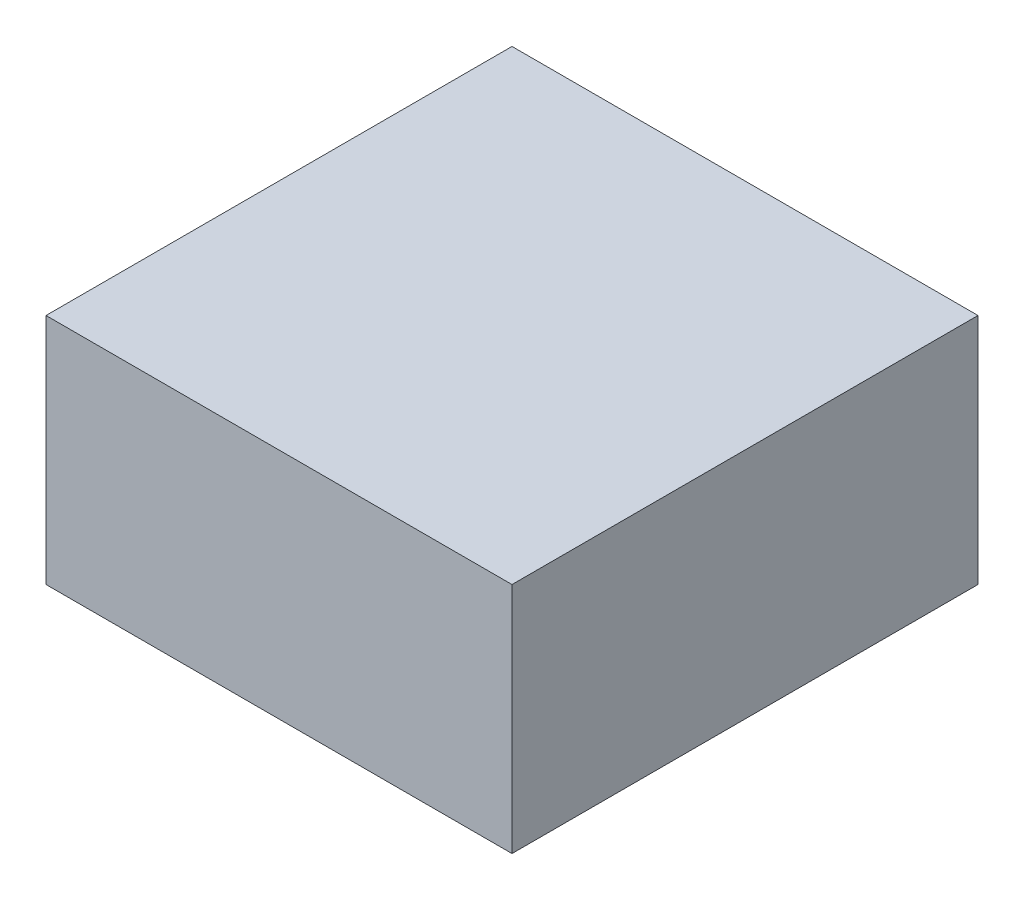
ISO-10303-21;
HEADER;
FILE_DESCRIPTION(('STEP AP214'),'2;1');
FILE_NAME('part.step','',(''),(''),'','','');
FILE_SCHEMA(('AUTOMOTIVE_DESIGN { 1 0 10303 214 1 1 1 1 }'));
ENDSEC;
DATA;
#1=APPLICATION_CONTEXT('core data for automotive mechanical design processes');
#2=APPLICATION_PROTOCOL_DEFINITION('international standard','automotive_design',2000,#1);
#3=PRODUCT_CONTEXT('',#1,'mechanical');
#4=PRODUCT('Part','Part','',(#3));
#5=PRODUCT_RELATED_PRODUCT_CATEGORY('part','',(#4));
#6=PRODUCT_DEFINITION_FORMATION('','',#4);
#7=PRODUCT_DEFINITION_CONTEXT('part definition',#1,'design');
#8=PRODUCT_DEFINITION('design','',#6,#7);
#9=PRODUCT_DEFINITION_SHAPE('','',#8);
#10=(LENGTH_UNIT() NAMED_UNIT(*) SI_UNIT(.MILLI.,.METRE.));
#11=(NAMED_UNIT(*) PLANE_ANGLE_UNIT() SI_UNIT($,.RADIAN.));
#12=(NAMED_UNIT(*) SI_UNIT($,.STERADIAN.) SOLID_ANGLE_UNIT());
#13=UNCERTAINTY_MEASURE_WITH_UNIT(LENGTH_MEASURE(1.E-05),#10,'distance_accuracy_value','');
#14=(GEOMETRIC_REPRESENTATION_CONTEXT(3) GLOBAL_UNCERTAINTY_ASSIGNED_CONTEXT((#13)) GLOBAL_UNIT_ASSIGNED_CONTEXT((#10,
#11,#12)) REPRESENTATION_CONTEXT('',''));
#15=CARTESIAN_POINT('',(0.,0.,0.));
#16=DIRECTION('',(0.,0.,1.));
#17=DIRECTION('',(1.,0.,0.));
#18=AXIS2_PLACEMENT_3D('',#15,#16,#17);
#19=CARTESIAN_POINT('',(250.,125.,250.));
#20=DIRECTION('',(-1.,0.,0.));
#21=DIRECTION('',(0.,0.,1.));
#22=AXIS2_PLACEMENT_3D('',#19,#20,#21);
#23=PLANE('',#22);
#24=DIRECTION('',(0.,0.,-1.));
#25=VECTOR('',#24,1.);
#26=CARTESIAN_POINT('',(250.,-125.,250.));
#27=LINE('',#26,#25);
#28=CARTESIAN_POINT('',(250.,-125.,250.));
#29=VERTEX_POINT('',#28);
#30=CARTESIAN_POINT('',(250.,-125.,-250.));
#31=VERTEX_POINT('',#30);
#32=EDGE_CURVE('E95',#29,#31,#27,.T.);
#33=ORIENTED_EDGE('',*,*,#32,.T.);
#34=DIRECTION('',(0.,-1.,0.));
#35=VECTOR('',#34,1.);
#36=CARTESIAN_POINT('',(250.,125.,-250.));
#37=LINE('',#36,#35);
#38=CARTESIAN_POINT('',(250.,125.,-250.));
#39=VERTEX_POINT('',#38);
#40=EDGE_CURVE('E11',#39,#31,#37,.T.);
#41=ORIENTED_EDGE('',*,*,#40,.F.);
#42=DIRECTION('',(0.,0.,-1.));
#43=VECTOR('',#42,1.);
#44=CARTESIAN_POINT('',(250.,125.,250.));
#45=LINE('',#44,#43);
#46=CARTESIAN_POINT('',(250.,125.,250.));
#47=VERTEX_POINT('',#46);
#48=EDGE_CURVE('E83',#47,#39,#45,.T.);
#49=ORIENTED_EDGE('',*,*,#48,.F.);
#50=DIRECTION('',(0.,-1.,0.));
#51=VECTOR('',#50,1.);
#52=CARTESIAN_POINT('',(250.,125.,250.));
#53=LINE('',#52,#51);
#54=EDGE_CURVE('E91',#47,#29,#53,.T.);
#55=ORIENTED_EDGE('',*,*,#54,.T.);
#56=EDGE_LOOP('',(#33,#41,#49,#55));
#57=FACE_BOUND('',#56,.T.);
#58=ADVANCED_FACE('F32',(#57),#23,.F.);
#59=CARTESIAN_POINT('',(-250.,125.,-250.));
#60=DIRECTION('',(0.,0.,1.));
#61=DIRECTION('',(1.,0.,0.));
#62=AXIS2_PLACEMENT_3D('',#59,#60,#61);
#63=PLANE('',#62);
#64=DIRECTION('',(-1.,0.,0.));
#65=VECTOR('',#64,1.);
#66=CARTESIAN_POINT('',(-250.,-125.,-250.));
#67=LINE('',#66,#65);
#68=CARTESIAN_POINT('',(-250.,-125.,-250.));
#69=VERTEX_POINT('',#68);
#70=EDGE_CURVE('E87',#31,#69,#67,.T.);
#71=ORIENTED_EDGE('',*,*,#70,.T.);
#72=DIRECTION('',(0.,-1.,0.));
#73=VECTOR('',#72,1.);
#74=CARTESIAN_POINT('',(-250.,125.,-250.));
#75=LINE('',#74,#73);
#76=CARTESIAN_POINT('',(-250.,125.,-250.));
#77=VERTEX_POINT('',#76);
#78=EDGE_CURVE('E40',#77,#69,#75,.T.);
#79=ORIENTED_EDGE('',*,*,#78,.F.);
#80=DIRECTION('',(-1.,0.,0.));
#81=VECTOR('',#80,1.);
#82=CARTESIAN_POINT('',(-250.,125.,-250.));
#83=LINE('',#82,#81);
#84=EDGE_CURVE('E78',#39,#77,#83,.T.);
#85=ORIENTED_EDGE('',*,*,#84,.F.);
#86=ORIENTED_EDGE('',*,*,#40,.T.);
#87=EDGE_LOOP('',(#71,#79,#85,#86));
#88=FACE_BOUND('',#87,.T.);
#89=ADVANCED_FACE('F86',(#88),#63,.F.);
#90=CARTESIAN_POINT('',(-250.,125.,250.));
#91=DIRECTION('',(1.,0.,0.));
#92=DIRECTION('',(0.,0.,-1.));
#93=AXIS2_PLACEMENT_3D('',#90,#91,#92);
#94=PLANE('',#93);
#95=DIRECTION('',(0.,0.,1.));
#96=VECTOR('',#95,1.);
#97=CARTESIAN_POINT('',(-250.,-125.,250.));
#98=LINE('',#97,#96);
#99=CARTESIAN_POINT('',(-250.,-125.,250.));
#100=VERTEX_POINT('',#99);
#101=EDGE_CURVE('E65',#69,#100,#98,.T.);
#102=ORIENTED_EDGE('',*,*,#101,.T.);
#103=DIRECTION('',(0.,-1.,0.));
#104=VECTOR('',#103,1.);
#105=CARTESIAN_POINT('',(-250.,125.,250.));
#106=LINE('',#105,#104);
#107=CARTESIAN_POINT('',(-250.,125.,250.));
#108=VERTEX_POINT('',#107);
#109=EDGE_CURVE('E88',#108,#100,#106,.T.);
#110=ORIENTED_EDGE('',*,*,#109,.F.);
#111=DIRECTION('',(0.,0.,1.));
#112=VECTOR('',#111,1.);
#113=CARTESIAN_POINT('',(-250.,125.,250.));
#114=LINE('',#113,#112);
#115=EDGE_CURVE('E81',#77,#108,#114,.T.);
#116=ORIENTED_EDGE('',*,*,#115,.F.);
#117=ORIENTED_EDGE('',*,*,#78,.T.);
#118=EDGE_LOOP('',(#102,#110,#116,#117));
#119=FACE_BOUND('',#118,.T.);
#120=ADVANCED_FACE('F89',(#119),#94,.F.);
#121=CARTESIAN_POINT('',(-250.,125.,250.));
#122=DIRECTION('',(0.,0.,-1.));
#123=DIRECTION('',(-1.,0.,0.));
#124=AXIS2_PLACEMENT_3D('',#121,#122,#123);
#125=PLANE('',#124);
#126=DIRECTION('',(1.,0.,0.));
#127=VECTOR('',#126,1.);
#128=CARTESIAN_POINT('',(-250.,-125.,250.));
#129=LINE('',#128,#127);
#130=EDGE_CURVE('E71',#100,#29,#129,.T.);
#131=ORIENTED_EDGE('',*,*,#130,.T.);
#132=ORIENTED_EDGE('',*,*,#54,.F.);
#133=DIRECTION('',(1.,0.,0.));
#134=VECTOR('',#133,1.);
#135=CARTESIAN_POINT('',(-250.,125.,250.));
#136=LINE('',#135,#134);
#137=EDGE_CURVE('E48',#108,#47,#136,.T.);
#138=ORIENTED_EDGE('',*,*,#137,.F.);
#139=ORIENTED_EDGE('',*,*,#109,.T.);
#140=EDGE_LOOP('',(#131,#132,#138,#139));
#141=FACE_BOUND('',#140,.T.);
#142=ADVANCED_FACE('F102',(#141),#125,.F.);
#143=CARTESIAN_POINT('',(250.,125.,-250.));
#144=DIRECTION('',(0.,-1.,0.));
#145=DIRECTION('',(0.,0.,-1.));
#146=AXIS2_PLACEMENT_3D('',#143,#144,#145);
#147=PLANE('',#146);
#148=ORIENTED_EDGE('',*,*,#48,.T.);
#149=ORIENTED_EDGE('',*,*,#84,.T.);
#150=ORIENTED_EDGE('',*,*,#115,.T.);
#151=ORIENTED_EDGE('',*,*,#137,.T.);
#152=EDGE_LOOP('',(#148,#149,#150,#151));
#153=FACE_BOUND('',#152,.T.);
#154=ADVANCED_FACE('F79',(#153),#147,.F.);
#155=CARTESIAN_POINT('',(250.,-125.,-250.));
#156=DIRECTION('',(0.,-1.,0.));
#157=DIRECTION('',(0.,0.,-1.));
#158=AXIS2_PLACEMENT_3D('',#155,#156,#157);
#159=PLANE('',#158);
#160=ORIENTED_EDGE('',*,*,#32,.F.);
#161=ORIENTED_EDGE('',*,*,#130,.F.);
#162=ORIENTED_EDGE('',*,*,#101,.F.);
#163=ORIENTED_EDGE('',*,*,#70,.F.);
#164=EDGE_LOOP('',(#160,#161,#162,#163));
#165=FACE_BOUND('',#164,.T.);
#166=ADVANCED_FACE('F105',(#165),#159,.T.);
#167=CLOSED_SHELL('',(#58,#89,#120,#142,#154,#166));
#168=MANIFOLD_SOLID_BREP('B2',#167);
#169=ADVANCED_BREP_SHAPE_REPRESENTATION('',(#18,#168),#14);
#170=SHAPE_DEFINITION_REPRESENTATION(#9,#169);
ENDSEC;
END-ISO-10303-21;
